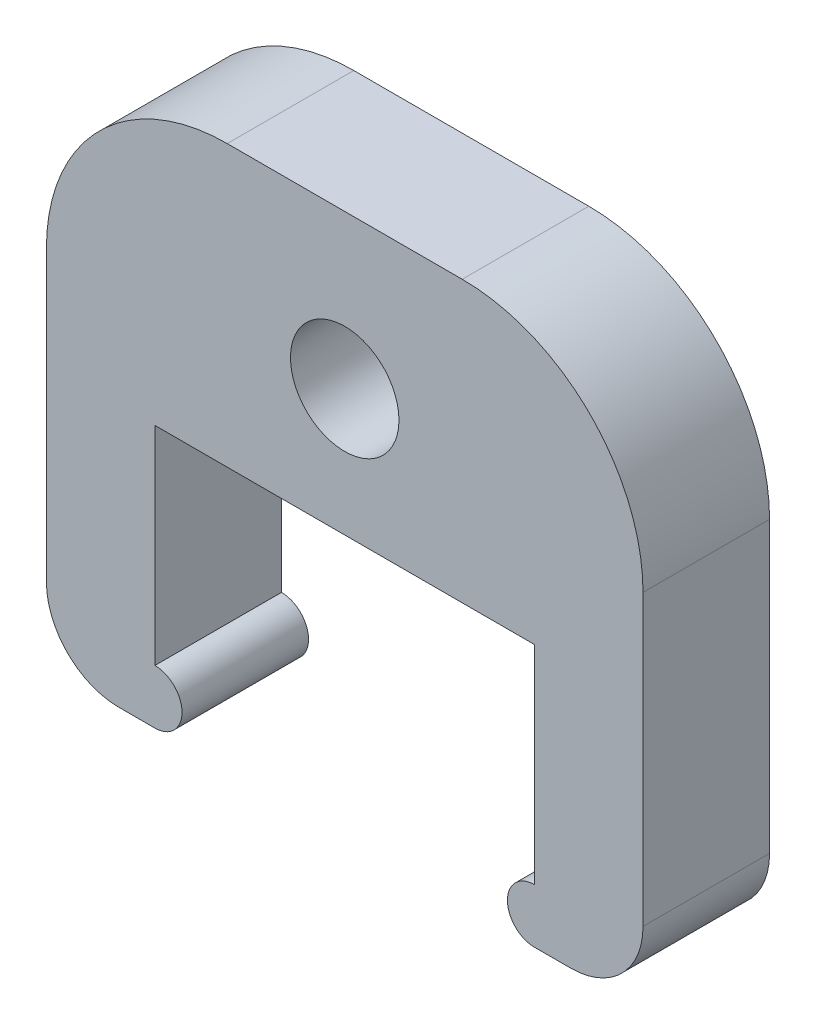
ISO-10303-21;
HEADER;
FILE_DESCRIPTION(('STEP AP214'),'2;1');
FILE_NAME('part.step','',(''),(''),'','','');
FILE_SCHEMA(('AUTOMOTIVE_DESIGN { 1 0 10303 214 1 1 1 1 }'));
ENDSEC;
DATA;
#1=APPLICATION_CONTEXT('core data for automotive mechanical design processes');
#2=APPLICATION_PROTOCOL_DEFINITION('international standard','automotive_design',2000,#1);
#3=PRODUCT_CONTEXT('',#1,'mechanical');
#4=PRODUCT('Part','Part','',(#3));
#5=PRODUCT_RELATED_PRODUCT_CATEGORY('part','',(#4));
#6=PRODUCT_DEFINITION_FORMATION('','',#4);
#7=PRODUCT_DEFINITION_CONTEXT('part definition',#1,'design');
#8=PRODUCT_DEFINITION('design','',#6,#7);
#9=PRODUCT_DEFINITION_SHAPE('','',#8);
#10=(LENGTH_UNIT() NAMED_UNIT(*) SI_UNIT(.MILLI.,.METRE.));
#11=(NAMED_UNIT(*) PLANE_ANGLE_UNIT() SI_UNIT($,.RADIAN.));
#12=(NAMED_UNIT(*) SI_UNIT($,.STERADIAN.) SOLID_ANGLE_UNIT());
#13=UNCERTAINTY_MEASURE_WITH_UNIT(LENGTH_MEASURE(1.E-05),#10,'distance_accuracy_value','');
#14=(GEOMETRIC_REPRESENTATION_CONTEXT(3) GLOBAL_UNCERTAINTY_ASSIGNED_CONTEXT((#13)) GLOBAL_UNIT_ASSIGNED_CONTEXT((#10,
#11,#12)) REPRESENTATION_CONTEXT('',''));
#15=CARTESIAN_POINT('',(0.,0.,0.));
#16=DIRECTION('',(0.,0.,1.));
#17=DIRECTION('',(1.,0.,0.));
#18=AXIS2_PLACEMENT_3D('',#15,#16,#17);
#19=CARTESIAN_POINT('',(13.5,0.75,3.5));
#20=DIRECTION('',(0.,0.,1.));
#21=DIRECTION('',(1.,0.,0.));
#22=AXIS2_PLACEMENT_3D('',#19,#20,#21);
#23=PLANE('',#22);
#24=DIRECTION('',(-1.,0.,0.));
#25=VECTOR('',#24,1.);
#26=CARTESIAN_POINT('',(0.,15.,3.5));
#27=LINE('',#26,#25);
#28=CARTESIAN_POINT('',(11.5,15.,3.5));
#29=VERTEX_POINT('',#28);
#30=CARTESIAN_POINT('',(5.,15.,3.5));
#31=VERTEX_POINT('',#30);
#32=EDGE_CURVE('E193',#29,#31,#27,.T.);
#33=ORIENTED_EDGE('',*,*,#32,.T.);
#34=CARTESIAN_POINT('',(5.,10.,3.5));
#35=DIRECTION('',(0.,0.,1.));
#36=DIRECTION('',(1.,0.,0.));
#37=AXIS2_PLACEMENT_3D('',#34,#35,#36);
#38=CIRCLE('',#37,5.);
#39=CARTESIAN_POINT('',(0.,10.,3.5));
#40=VERTEX_POINT('',#39);
#41=EDGE_CURVE('E48',#31,#40,#38,.T.);
#42=ORIENTED_EDGE('',*,*,#41,.T.);
#43=DIRECTION('',(0.,-1.,0.));
#44=VECTOR('',#43,1.);
#45=CARTESIAN_POINT('',(0.,0.,3.5));
#46=LINE('',#45,#44);
#47=CARTESIAN_POINT('',(0.,2.,3.5));
#48=VERTEX_POINT('',#47);
#49=EDGE_CURVE('E154',#40,#48,#46,.T.);
#50=ORIENTED_EDGE('',*,*,#49,.T.);
#51=CARTESIAN_POINT('',(2.,2.,3.5));
#52=DIRECTION('',(0.,0.,1.));
#53=DIRECTION('',(1.,0.,0.));
#54=AXIS2_PLACEMENT_3D('',#51,#52,#53);
#55=CIRCLE('',#54,2.);
#56=CARTESIAN_POINT('',(2.,0.,3.5));
#57=VERTEX_POINT('',#56);
#58=EDGE_CURVE('E149',#48,#57,#55,.T.);
#59=ORIENTED_EDGE('',*,*,#58,.T.);
#60=DIRECTION('',(1.,0.,0.));
#61=VECTOR('',#60,1.);
#62=CARTESIAN_POINT('',(0.,0.,3.5));
#63=LINE('',#62,#61);
#64=CARTESIAN_POINT('',(3.,0.,3.5));
#65=VERTEX_POINT('',#64);
#66=EDGE_CURVE('E142',#57,#65,#63,.T.);
#67=ORIENTED_EDGE('',*,*,#66,.T.);
#68=CARTESIAN_POINT('',(3.,0.75,3.5));
#69=DIRECTION('',(0.,0.,1.));
#70=DIRECTION('',(1.,0.,0.));
#71=AXIS2_PLACEMENT_3D('',#68,#69,#70);
#72=CIRCLE('',#71,0.75);
#73=CARTESIAN_POINT('',(3.,1.5,3.5));
#74=VERTEX_POINT('',#73);
#75=EDGE_CURVE('E146',#65,#74,#72,.T.);
#76=ORIENTED_EDGE('',*,*,#75,.T.);
#77=DIRECTION('',(0.,1.,0.));
#78=VECTOR('',#77,1.);
#79=CARTESIAN_POINT('',(3.,1.5,3.5));
#80=LINE('',#79,#78);
#81=CARTESIAN_POINT('',(3.,7.25,3.5));
#82=VERTEX_POINT('',#81);
#83=EDGE_CURVE('E171',#74,#82,#80,.T.);
#84=ORIENTED_EDGE('',*,*,#83,.T.);
#85=DIRECTION('',(1.,0.,0.));
#86=VECTOR('',#85,1.);
#87=CARTESIAN_POINT('',(3.,7.25,3.5));
#88=LINE('',#87,#86);
#89=CARTESIAN_POINT('',(13.5,7.25,3.5));
#90=VERTEX_POINT('',#89);
#91=EDGE_CURVE('E174',#82,#90,#88,.T.);
#92=ORIENTED_EDGE('',*,*,#91,.T.);
#93=DIRECTION('',(0.,-1.,0.));
#94=VECTOR('',#93,1.);
#95=CARTESIAN_POINT('',(13.5,7.25,3.5));
#96=LINE('',#95,#94);
#97=CARTESIAN_POINT('',(13.5,1.5,3.5));
#98=VERTEX_POINT('',#97);
#99=EDGE_CURVE('E180',#90,#98,#96,.T.);
#100=ORIENTED_EDGE('',*,*,#99,.T.);
#101=CARTESIAN_POINT('',(13.5,0.75,3.5));
#102=DIRECTION('',(0.,0.,1.));
#103=DIRECTION('',(1.,0.,0.));
#104=AXIS2_PLACEMENT_3D('',#101,#102,#103);
#105=CIRCLE('',#104,0.75);
#106=CARTESIAN_POINT('',(13.5,0.,3.5));
#107=VERTEX_POINT('',#106);
#108=EDGE_CURVE('E183',#98,#107,#105,.T.);
#109=ORIENTED_EDGE('',*,*,#108,.T.);
#110=DIRECTION('',(1.,0.,0.));
#111=VECTOR('',#110,1.);
#112=CARTESIAN_POINT('',(13.5,0.,3.5));
#113=LINE('',#112,#111);
#114=CARTESIAN_POINT('',(14.5,0.,3.5));
#115=VERTEX_POINT('',#114);
#116=EDGE_CURVE('E186',#107,#115,#113,.T.);
#117=ORIENTED_EDGE('',*,*,#116,.T.);
#118=CARTESIAN_POINT('',(14.5,2.,3.5));
#119=DIRECTION('',(0.,0.,1.));
#120=DIRECTION('',(1.,0.,0.));
#121=AXIS2_PLACEMENT_3D('',#118,#119,#120);
#122=CIRCLE('',#121,2.);
#123=CARTESIAN_POINT('',(16.5,2.,3.5));
#124=VERTEX_POINT('',#123);
#125=EDGE_CURVE('E260',#115,#124,#122,.T.);
#126=ORIENTED_EDGE('',*,*,#125,.T.);
#127=DIRECTION('',(0.,1.,0.));
#128=VECTOR('',#127,1.);
#129=CARTESIAN_POINT('',(16.5,15.,3.5));
#130=LINE('',#129,#128);
#131=CARTESIAN_POINT('',(16.5,10.,3.5));
#132=VERTEX_POINT('',#131);
#133=EDGE_CURVE('E190',#124,#132,#130,.T.);
#134=ORIENTED_EDGE('',*,*,#133,.T.);
#135=CARTESIAN_POINT('',(11.5,10.,3.5));
#136=DIRECTION('',(0.,0.,1.));
#137=DIRECTION('',(1.,0.,0.));
#138=AXIS2_PLACEMENT_3D('',#135,#136,#137);
#139=CIRCLE('',#138,5.);
#140=EDGE_CURVE('E286',#132,#29,#139,.T.);
#141=ORIENTED_EDGE('',*,*,#140,.T.);
#142=EDGE_LOOP('',(#33,#42,#50,#59,#67,#76,#84,#92,#100,#109,#117,#126,#134,#141));
#143=FACE_BOUND('',#142,.T.);
#144=CARTESIAN_POINT('',(8.25,10.75,3.5));
#145=DIRECTION('',(0.,0.,1.));
#146=DIRECTION('',(1.,0.,0.));
#147=AXIS2_PLACEMENT_3D('',#144,#145,#146);
#148=CIRCLE('',#147,1.5);
#149=CARTESIAN_POINT('',(9.75,10.75,3.5));
#150=VERTEX_POINT('',#149);
#151=EDGE_CURVE('E200',#150,#150,#148,.T.);
#152=ORIENTED_EDGE('',*,*,#151,.F.);
#153=EDGE_LOOP('',(#152));
#154=FACE_BOUND('',#153,.T.);
#155=ADVANCED_FACE('F39',(#143,#154),#23,.T.);
#156=CARTESIAN_POINT('',(13.5,0.75,0.));
#157=DIRECTION('',(0.,0.,1.));
#158=DIRECTION('',(1.,0.,0.));
#159=AXIS2_PLACEMENT_3D('',#156,#157,#158);
#160=PLANE('',#159);
#161=DIRECTION('',(0.,-1.,0.));
#162=VECTOR('',#161,1.);
#163=CARTESIAN_POINT('',(0.,0.,0.));
#164=LINE('',#163,#162);
#165=CARTESIAN_POINT('',(0.,10.,0.));
#166=VERTEX_POINT('',#165);
#167=CARTESIAN_POINT('',(0.,2.,0.));
#168=VERTEX_POINT('',#167);
#169=EDGE_CURVE('E197',#166,#168,#164,.T.);
#170=ORIENTED_EDGE('',*,*,#169,.F.);
#171=CARTESIAN_POINT('',(5.,10.,0.));
#172=DIRECTION('',(0.,0.,1.));
#173=DIRECTION('',(1.,0.,0.));
#174=AXIS2_PLACEMENT_3D('',#171,#172,#173);
#175=CIRCLE('',#174,5.);
#176=CARTESIAN_POINT('',(5.,15.,0.));
#177=VERTEX_POINT('',#176);
#178=EDGE_CURVE('E277',#166,#177,#175,.F.);
#179=ORIENTED_EDGE('',*,*,#178,.T.);
#180=DIRECTION('',(-1.,0.,0.));
#181=VECTOR('',#180,1.);
#182=CARTESIAN_POINT('',(0.,15.,0.));
#183=LINE('',#182,#181);
#184=CARTESIAN_POINT('',(11.5,15.,0.));
#185=VERTEX_POINT('',#184);
#186=EDGE_CURVE('E225',#185,#177,#183,.T.);
#187=ORIENTED_EDGE('',*,*,#186,.F.);
#188=CARTESIAN_POINT('',(11.5,10.,0.));
#189=DIRECTION('',(0.,0.,1.));
#190=DIRECTION('',(1.,0.,0.));
#191=AXIS2_PLACEMENT_3D('',#188,#189,#190);
#192=CIRCLE('',#191,5.);
#193=CARTESIAN_POINT('',(16.5,10.,0.));
#194=VERTEX_POINT('',#193);
#195=EDGE_CURVE('E274',#185,#194,#192,.F.);
#196=ORIENTED_EDGE('',*,*,#195,.T.);
#197=DIRECTION('',(0.,1.,0.));
#198=VECTOR('',#197,1.);
#199=CARTESIAN_POINT('',(16.5,15.,0.));
#200=LINE('',#199,#198);
#201=CARTESIAN_POINT('',(16.5,2.,0.));
#202=VERTEX_POINT('',#201);
#203=EDGE_CURVE('E222',#202,#194,#200,.T.);
#204=ORIENTED_EDGE('',*,*,#203,.F.);
#205=CARTESIAN_POINT('',(14.5,2.,0.));
#206=DIRECTION('',(0.,0.,1.));
#207=DIRECTION('',(1.,0.,0.));
#208=AXIS2_PLACEMENT_3D('',#205,#206,#207);
#209=CIRCLE('',#208,2.);
#210=CARTESIAN_POINT('',(14.5,0.,0.));
#211=VERTEX_POINT('',#210);
#212=EDGE_CURVE('E252',#202,#211,#209,.F.);
#213=ORIENTED_EDGE('',*,*,#212,.T.);
#214=DIRECTION('',(1.,0.,0.));
#215=VECTOR('',#214,1.);
#216=CARTESIAN_POINT('',(13.5,0.,0.));
#217=LINE('',#216,#215);
#218=CARTESIAN_POINT('',(13.5,0.,0.));
#219=VERTEX_POINT('',#218);
#220=EDGE_CURVE('E218',#219,#211,#217,.T.);
#221=ORIENTED_EDGE('',*,*,#220,.F.);
#222=CARTESIAN_POINT('',(13.5,0.75,0.));
#223=DIRECTION('',(0.,0.,1.));
#224=DIRECTION('',(1.,0.,0.));
#225=AXIS2_PLACEMENT_3D('',#222,#223,#224);
#226=CIRCLE('',#225,0.75);
#227=CARTESIAN_POINT('',(13.5,1.5,0.));
#228=VERTEX_POINT('',#227);
#229=EDGE_CURVE('E215',#228,#219,#226,.T.);
#230=ORIENTED_EDGE('',*,*,#229,.F.);
#231=DIRECTION('',(0.,-1.,0.));
#232=VECTOR('',#231,1.);
#233=CARTESIAN_POINT('',(13.5,7.25,0.));
#234=LINE('',#233,#232);
#235=CARTESIAN_POINT('',(13.5,7.25,0.));
#236=VERTEX_POINT('',#235);
#237=EDGE_CURVE('E212',#236,#228,#234,.T.);
#238=ORIENTED_EDGE('',*,*,#237,.F.);
#239=DIRECTION('',(1.,0.,0.));
#240=VECTOR('',#239,1.);
#241=CARTESIAN_POINT('',(3.,7.25,0.));
#242=LINE('',#241,#240);
#243=CARTESIAN_POINT('',(3.,7.25,0.));
#244=VERTEX_POINT('',#243);
#245=EDGE_CURVE('E209',#244,#236,#242,.T.);
#246=ORIENTED_EDGE('',*,*,#245,.F.);
#247=DIRECTION('',(0.,1.,0.));
#248=VECTOR('',#247,1.);
#249=CARTESIAN_POINT('',(3.,1.5,0.));
#250=LINE('',#249,#248);
#251=CARTESIAN_POINT('',(3.,1.5,0.));
#252=VERTEX_POINT('',#251);
#253=EDGE_CURVE('E206',#252,#244,#250,.T.);
#254=ORIENTED_EDGE('',*,*,#253,.F.);
#255=CARTESIAN_POINT('',(3.,0.75,0.));
#256=DIRECTION('',(0.,0.,1.));
#257=DIRECTION('',(1.,0.,0.));
#258=AXIS2_PLACEMENT_3D('',#255,#256,#257);
#259=CIRCLE('',#258,0.75);
#260=CARTESIAN_POINT('',(3.,0.,0.));
#261=VERTEX_POINT('',#260);
#262=EDGE_CURVE('E203',#261,#252,#259,.T.);
#263=ORIENTED_EDGE('',*,*,#262,.F.);
#264=DIRECTION('',(1.,0.,0.));
#265=VECTOR('',#264,1.);
#266=CARTESIAN_POINT('',(0.,0.,0.));
#267=LINE('',#266,#265);
#268=CARTESIAN_POINT('',(2.,0.,0.));
#269=VERTEX_POINT('',#268);
#270=EDGE_CURVE('E160',#269,#261,#267,.T.);
#271=ORIENTED_EDGE('',*,*,#270,.F.);
#272=CARTESIAN_POINT('',(2.,2.,0.));
#273=DIRECTION('',(0.,0.,1.));
#274=DIRECTION('',(1.,0.,0.));
#275=AXIS2_PLACEMENT_3D('',#272,#273,#274);
#276=CIRCLE('',#275,2.);
#277=EDGE_CURVE('E248',#269,#168,#276,.F.);
#278=ORIENTED_EDGE('',*,*,#277,.T.);
#279=EDGE_LOOP('',(#170,#179,#187,#196,#204,#213,#221,#230,#238,#246,#254,#263,#271,#278));
#280=FACE_BOUND('',#279,.T.);
#281=CARTESIAN_POINT('',(8.25,10.75,0.));
#282=DIRECTION('',(0.,0.,1.));
#283=DIRECTION('',(1.,0.,0.));
#284=AXIS2_PLACEMENT_3D('',#281,#282,#283);
#285=CIRCLE('',#284,1.5);
#286=CARTESIAN_POINT('',(9.75,10.75,0.));
#287=VERTEX_POINT('',#286);
#288=EDGE_CURVE('E480',#287,#287,#285,.T.);
#289=ORIENTED_EDGE('',*,*,#288,.T.);
#290=EDGE_LOOP('',(#289));
#291=FACE_BOUND('',#290,.T.);
#292=ADVANCED_FACE('F301',(#280,#291),#160,.F.);
#293=CARTESIAN_POINT('',(0.,0.,3.5));
#294=DIRECTION('',(1.,0.,0.));
#295=DIRECTION('',(0.,0.,-1.));
#296=AXIS2_PLACEMENT_3D('',#293,#294,#295);
#297=PLANE('',#296);
#298=ORIENTED_EDGE('',*,*,#49,.F.);
#299=DIRECTION('',(0.,0.,-1.));
#300=VECTOR('',#299,1.);
#301=CARTESIAN_POINT('',(0.,10.,3.5));
#302=LINE('',#301,#300);
#303=EDGE_CURVE('E270',#40,#166,#302,.T.);
#304=ORIENTED_EDGE('',*,*,#303,.T.);
#305=ORIENTED_EDGE('',*,*,#169,.T.);
#306=DIRECTION('',(0.,0.,-1.));
#307=VECTOR('',#306,1.);
#308=CARTESIAN_POINT('',(0.,2.,3.5));
#309=LINE('',#308,#307);
#310=EDGE_CURVE('E266',#168,#48,#309,.F.);
#311=ORIENTED_EDGE('',*,*,#310,.T.);
#312=EDGE_LOOP('',(#298,#304,#305,#311));
#313=FACE_BOUND('',#312,.T.);
#314=ADVANCED_FACE('F294',(#313),#297,.F.);
#315=CARTESIAN_POINT('',(0.,0.,3.5));
#316=DIRECTION('',(0.,1.,0.));
#317=DIRECTION('',(0.,0.,1.));
#318=AXIS2_PLACEMENT_3D('',#315,#316,#317);
#319=PLANE('',#318);
#320=ORIENTED_EDGE('',*,*,#66,.F.);
#321=DIRECTION('',(0.,0.,-1.));
#322=VECTOR('',#321,1.);
#323=CARTESIAN_POINT('',(2.,0.,3.5));
#324=LINE('',#323,#322);
#325=EDGE_CURVE('E263',#57,#269,#324,.T.);
#326=ORIENTED_EDGE('',*,*,#325,.T.);
#327=ORIENTED_EDGE('',*,*,#270,.T.);
#328=DIRECTION('',(0.,0.,-1.));
#329=VECTOR('',#328,1.);
#330=CARTESIAN_POINT('',(3.,0.,3.5));
#331=LINE('',#330,#329);
#332=EDGE_CURVE('E157',#65,#261,#331,.T.);
#333=ORIENTED_EDGE('',*,*,#332,.F.);
#334=EDGE_LOOP('',(#320,#326,#327,#333));
#335=FACE_BOUND('',#334,.T.);
#336=ADVANCED_FACE('F158',(#335),#319,.F.);
#337=CARTESIAN_POINT('',(3.,0.75,3.5));
#338=DIRECTION('',(0.,0.,-1.));
#339=DIRECTION('',(-1.,0.,0.));
#340=AXIS2_PLACEMENT_3D('',#337,#338,#339);
#341=CYLINDRICAL_SURFACE('',#340,0.75);
#342=ORIENTED_EDGE('',*,*,#262,.T.);
#343=DIRECTION('',(0.,0.,-1.));
#344=VECTOR('',#343,1.);
#345=CARTESIAN_POINT('',(3.,1.5,3.5));
#346=LINE('',#345,#344);
#347=EDGE_CURVE('E165',#74,#252,#346,.T.);
#348=ORIENTED_EDGE('',*,*,#347,.F.);
#349=ORIENTED_EDGE('',*,*,#75,.F.);
#350=ORIENTED_EDGE('',*,*,#332,.T.);
#351=EDGE_LOOP('',(#342,#348,#349,#350));
#352=FACE_BOUND('',#351,.T.);
#353=ADVANCED_FACE('F167',(#352),#341,.T.);
#354=CARTESIAN_POINT('',(3.,1.5,3.5));
#355=DIRECTION('',(-1.,0.,0.));
#356=DIRECTION('',(0.,0.,1.));
#357=AXIS2_PLACEMENT_3D('',#354,#355,#356);
#358=PLANE('',#357);
#359=ORIENTED_EDGE('',*,*,#253,.T.);
#360=DIRECTION('',(0.,0.,-1.));
#361=VECTOR('',#360,1.);
#362=CARTESIAN_POINT('',(3.,7.25,3.5));
#363=LINE('',#362,#361);
#364=EDGE_CURVE('E239',#82,#244,#363,.T.);
#365=ORIENTED_EDGE('',*,*,#364,.F.);
#366=ORIENTED_EDGE('',*,*,#83,.F.);
#367=ORIENTED_EDGE('',*,*,#347,.T.);
#368=EDGE_LOOP('',(#359,#365,#366,#367));
#369=FACE_BOUND('',#368,.T.);
#370=ADVANCED_FACE('F336',(#369),#358,.F.);
#371=CARTESIAN_POINT('',(3.,7.25,3.5));
#372=DIRECTION('',(0.,1.,0.));
#373=DIRECTION('',(0.,0.,1.));
#374=AXIS2_PLACEMENT_3D('',#371,#372,#373);
#375=PLANE('',#374);
#376=ORIENTED_EDGE('',*,*,#245,.T.);
#377=DIRECTION('',(0.,0.,-1.));
#378=VECTOR('',#377,1.);
#379=CARTESIAN_POINT('',(13.5,7.25,3.5));
#380=LINE('',#379,#378);
#381=EDGE_CURVE('E235',#90,#236,#380,.T.);
#382=ORIENTED_EDGE('',*,*,#381,.F.);
#383=ORIENTED_EDGE('',*,*,#91,.F.);
#384=ORIENTED_EDGE('',*,*,#364,.T.);
#385=EDGE_LOOP('',(#376,#382,#383,#384));
#386=FACE_BOUND('',#385,.T.);
#387=ADVANCED_FACE('F333',(#386),#375,.F.);
#388=CARTESIAN_POINT('',(13.5,7.25,3.5));
#389=DIRECTION('',(1.,0.,0.));
#390=DIRECTION('',(0.,1.,0.));
#391=AXIS2_PLACEMENT_3D('',#388,#389,#390);
#392=PLANE('',#391);
#393=ORIENTED_EDGE('',*,*,#237,.T.);
#394=DIRECTION('',(0.,0.,-1.));
#395=VECTOR('',#394,1.);
#396=CARTESIAN_POINT('',(13.5,1.5,3.5));
#397=LINE('',#396,#395);
#398=EDGE_CURVE('E231',#98,#228,#397,.T.);
#399=ORIENTED_EDGE('',*,*,#398,.F.);
#400=ORIENTED_EDGE('',*,*,#99,.F.);
#401=ORIENTED_EDGE('',*,*,#381,.T.);
#402=EDGE_LOOP('',(#393,#399,#400,#401));
#403=FACE_BOUND('',#402,.T.);
#404=ADVANCED_FACE('F328',(#403),#392,.F.);
#405=CARTESIAN_POINT('',(13.5,0.75,3.5));
#406=DIRECTION('',(0.,0.,-1.));
#407=DIRECTION('',(-1.,0.,0.));
#408=AXIS2_PLACEMENT_3D('',#405,#406,#407);
#409=CYLINDRICAL_SURFACE('',#408,0.75);
#410=ORIENTED_EDGE('',*,*,#229,.T.);
#411=DIRECTION('',(0.,0.,-1.));
#412=VECTOR('',#411,1.);
#413=CARTESIAN_POINT('',(13.5,0.,3.5));
#414=LINE('',#413,#412);
#415=EDGE_CURVE('E196',#107,#219,#414,.T.);
#416=ORIENTED_EDGE('',*,*,#415,.F.);
#417=ORIENTED_EDGE('',*,*,#108,.F.);
#418=ORIENTED_EDGE('',*,*,#398,.T.);
#419=EDGE_LOOP('',(#410,#416,#417,#418));
#420=FACE_BOUND('',#419,.T.);
#421=ADVANCED_FACE('F322',(#420),#409,.T.);
#422=CARTESIAN_POINT('',(13.5,0.,3.5));
#423=DIRECTION('',(0.,1.,0.));
#424=DIRECTION('',(0.,0.,1.));
#425=AXIS2_PLACEMENT_3D('',#422,#423,#424);
#426=PLANE('',#425);
#427=ORIENTED_EDGE('',*,*,#220,.T.);
#428=DIRECTION('',(0.,0.,-1.));
#429=VECTOR('',#428,1.);
#430=CARTESIAN_POINT('',(14.5,0.,3.5));
#431=LINE('',#430,#429);
#432=EDGE_CURVE('E255',#211,#115,#431,.F.);
#433=ORIENTED_EDGE('',*,*,#432,.T.);
#434=ORIENTED_EDGE('',*,*,#116,.F.);
#435=ORIENTED_EDGE('',*,*,#415,.T.);
#436=EDGE_LOOP('',(#427,#433,#434,#435));
#437=FACE_BOUND('',#436,.T.);
#438=ADVANCED_FACE('F317',(#437),#426,.F.);
#439=CARTESIAN_POINT('',(16.5,15.,3.5));
#440=DIRECTION('',(-1.,0.,0.));
#441=DIRECTION('',(0.,-1.,0.));
#442=AXIS2_PLACEMENT_3D('',#439,#440,#441);
#443=PLANE('',#442);
#444=ORIENTED_EDGE('',*,*,#203,.T.);
#445=DIRECTION('',(0.,0.,-1.));
#446=VECTOR('',#445,1.);
#447=CARTESIAN_POINT('',(16.5,10.,3.5));
#448=LINE('',#447,#446);
#449=EDGE_CURVE('E11',#194,#132,#448,.F.);
#450=ORIENTED_EDGE('',*,*,#449,.T.);
#451=ORIENTED_EDGE('',*,*,#133,.F.);
#452=DIRECTION('',(0.,0.,-1.));
#453=VECTOR('',#452,1.);
#454=CARTESIAN_POINT('',(16.5,2.,3.5));
#455=LINE('',#454,#453);
#456=EDGE_CURVE('E164',#124,#202,#455,.T.);
#457=ORIENTED_EDGE('',*,*,#456,.T.);
#458=EDGE_LOOP('',(#444,#450,#451,#457));
#459=FACE_BOUND('',#458,.T.);
#460=ADVANCED_FACE('F308',(#459),#443,.F.);
#461=CARTESIAN_POINT('',(0.,15.,3.5));
#462=DIRECTION('',(0.,-1.,0.));
#463=DIRECTION('',(0.,0.,-1.));
#464=AXIS2_PLACEMENT_3D('',#461,#462,#463);
#465=PLANE('',#464);
#466=ORIENTED_EDGE('',*,*,#186,.T.);
#467=DIRECTION('',(0.,0.,-1.));
#468=VECTOR('',#467,1.);
#469=CARTESIAN_POINT('',(5.,15.,3.5));
#470=LINE('',#469,#468);
#471=EDGE_CURVE('E61',#177,#31,#470,.F.);
#472=ORIENTED_EDGE('',*,*,#471,.T.);
#473=ORIENTED_EDGE('',*,*,#32,.F.);
#474=DIRECTION('',(0.,0.,-1.));
#475=VECTOR('',#474,1.);
#476=CARTESIAN_POINT('',(11.5,15.,3.5));
#477=LINE('',#476,#475);
#478=EDGE_CURVE('E280',#29,#185,#477,.T.);
#479=ORIENTED_EDGE('',*,*,#478,.T.);
#480=EDGE_LOOP('',(#466,#472,#473,#479));
#481=FACE_BOUND('',#480,.T.);
#482=ADVANCED_FACE('F303',(#481),#465,.F.);
#483=CARTESIAN_POINT('',(8.25,10.75,3.5));
#484=DIRECTION('',(0.,0.,-1.));
#485=DIRECTION('',(-1.,0.,0.));
#486=AXIS2_PLACEMENT_3D('',#483,#484,#485);
#487=CYLINDRICAL_SURFACE('',#486,1.5);
#488=ORIENTED_EDGE('',*,*,#151,.T.);
#489=EDGE_LOOP('',(#488));
#490=FACE_BOUND('',#489,.T.);
#491=ORIENTED_EDGE('',*,*,#288,.F.);
#492=EDGE_LOOP('',(#491));
#493=FACE_BOUND('',#492,.T.);
#494=ADVANCED_FACE('F345',(#490,#493),#487,.F.);
#495=CARTESIAN_POINT('',(14.5,2.,3.5));
#496=DIRECTION('',(0.,0.,-1.));
#497=DIRECTION('',(-1.,0.,0.));
#498=AXIS2_PLACEMENT_3D('',#495,#496,#497);
#499=CYLINDRICAL_SURFACE('',#498,2.);
#500=ORIENTED_EDGE('',*,*,#125,.F.);
#501=ORIENTED_EDGE('',*,*,#432,.F.);
#502=ORIENTED_EDGE('',*,*,#212,.F.);
#503=ORIENTED_EDGE('',*,*,#456,.F.);
#504=EDGE_LOOP('',(#500,#501,#502,#503));
#505=FACE_BOUND('',#504,.T.);
#506=ADVANCED_FACE('F312',(#505),#499,.T.);
#507=CARTESIAN_POINT('',(2.,2.,3.5));
#508=DIRECTION('',(0.,0.,-1.));
#509=DIRECTION('',(-1.,0.,0.));
#510=AXIS2_PLACEMENT_3D('',#507,#508,#509);
#511=CYLINDRICAL_SURFACE('',#510,2.);
#512=ORIENTED_EDGE('',*,*,#58,.F.);
#513=ORIENTED_EDGE('',*,*,#310,.F.);
#514=ORIENTED_EDGE('',*,*,#277,.F.);
#515=ORIENTED_EDGE('',*,*,#325,.F.);
#516=EDGE_LOOP('',(#512,#513,#514,#515));
#517=FACE_BOUND('',#516,.T.);
#518=ADVANCED_FACE('F338',(#517),#511,.T.);
#519=CARTESIAN_POINT('',(5.,10.,3.5));
#520=DIRECTION('',(0.,0.,-1.));
#521=DIRECTION('',(-1.,0.,0.));
#522=AXIS2_PLACEMENT_3D('',#519,#520,#521);
#523=CYLINDRICAL_SURFACE('',#522,5.);
#524=ORIENTED_EDGE('',*,*,#41,.F.);
#525=ORIENTED_EDGE('',*,*,#471,.F.);
#526=ORIENTED_EDGE('',*,*,#178,.F.);
#527=ORIENTED_EDGE('',*,*,#303,.F.);
#528=EDGE_LOOP('',(#524,#525,#526,#527));
#529=FACE_BOUND('',#528,.T.);
#530=ADVANCED_FACE('F298',(#529),#523,.T.);
#531=CARTESIAN_POINT('',(11.5,10.,3.5));
#532=DIRECTION('',(0.,0.,-1.));
#533=DIRECTION('',(-1.,0.,0.));
#534=AXIS2_PLACEMENT_3D('',#531,#532,#533);
#535=CYLINDRICAL_SURFACE('',#534,5.);
#536=ORIENTED_EDGE('',*,*,#140,.F.);
#537=ORIENTED_EDGE('',*,*,#449,.F.);
#538=ORIENTED_EDGE('',*,*,#195,.F.);
#539=ORIENTED_EDGE('',*,*,#478,.F.);
#540=EDGE_LOOP('',(#536,#537,#538,#539));
#541=FACE_BOUND('',#540,.T.);
#542=ADVANCED_FACE('F41',(#541),#535,.T.);
#543=CLOSED_SHELL('',(#155,#292,#314,#336,#353,#370,#387,#404,#421,#438,#460,#482,#494,#506,
#518,#530,#542));
#544=MANIFOLD_SOLID_BREP('B2',#543);
#545=ADVANCED_BREP_SHAPE_REPRESENTATION('',(#18,#544),#14);
#546=SHAPE_DEFINITION_REPRESENTATION(#9,#545);
ENDSEC;
END-ISO-10303-21;
